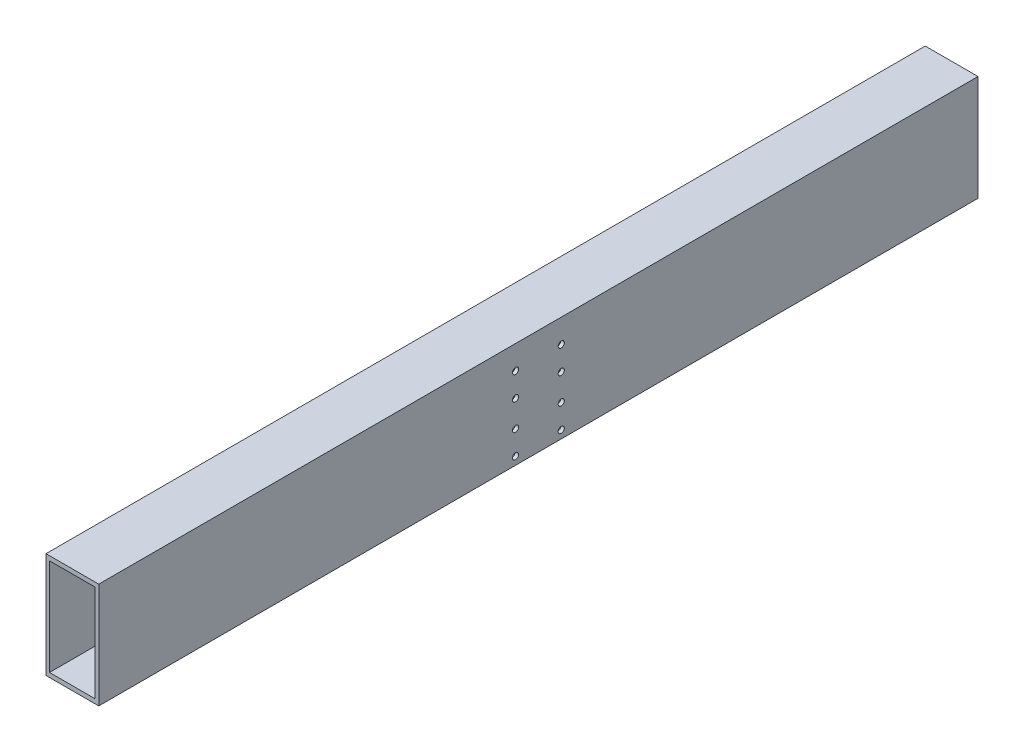
ISO-10303-21;
HEADER;
FILE_DESCRIPTION(('STEP AP214'),'2;1');
FILE_NAME('part.step','',(''),(''),'','','');
FILE_SCHEMA(('AUTOMOTIVE_DESIGN { 1 0 10303 214 1 1 1 1 }'));
ENDSEC;
DATA;
#1=APPLICATION_CONTEXT('core data for automotive mechanical design processes');
#2=APPLICATION_PROTOCOL_DEFINITION('international standard','automotive_design',2000,#1);
#3=PRODUCT_CONTEXT('',#1,'mechanical');
#4=PRODUCT('Part','Part','',(#3));
#5=PRODUCT_RELATED_PRODUCT_CATEGORY('part','',(#4));
#6=PRODUCT_DEFINITION_FORMATION('','',#4);
#7=PRODUCT_DEFINITION_CONTEXT('part definition',#1,'design');
#8=PRODUCT_DEFINITION('design','',#6,#7);
#9=PRODUCT_DEFINITION_SHAPE('','',#8);
#10=(LENGTH_UNIT() NAMED_UNIT(*) SI_UNIT(.MILLI.,.METRE.));
#11=(NAMED_UNIT(*) PLANE_ANGLE_UNIT() SI_UNIT($,.RADIAN.));
#12=(NAMED_UNIT(*) SI_UNIT($,.STERADIAN.) SOLID_ANGLE_UNIT());
#13=UNCERTAINTY_MEASURE_WITH_UNIT(LENGTH_MEASURE(1.E-05),#10,'distance_accuracy_value','');
#14=(GEOMETRIC_REPRESENTATION_CONTEXT(3) GLOBAL_UNCERTAINTY_ASSIGNED_CONTEXT((#13)) GLOBAL_UNIT_ASSIGNED_CONTEXT((#10,
#11,#12)) REPRESENTATION_CONTEXT('',''));
#15=CARTESIAN_POINT('',(0.,0.,0.));
#16=DIRECTION('',(0.,0.,1.));
#17=DIRECTION('',(1.,0.,0.));
#18=AXIS2_PLACEMENT_3D('',#15,#16,#17);
#19=CARTESIAN_POINT('',(-30.,60.,500.));
#20=DIRECTION('',(1.,0.,0.));
#21=DIRECTION('',(0.,0.,-1.));
#22=AXIS2_PLACEMENT_3D('',#19,#20,#21);
#23=PLANE('',#22);
#24=CARTESIAN_POINT('',(-30.,33.,26.));
#25=DIRECTION('',(1.,0.,0.));
#26=DIRECTION('',(0.,0.,-1.));
#27=AXIS2_PLACEMENT_3D('',#24,#25,#26);
#28=CIRCLE('',#27,3.49999999999999);
#29=CARTESIAN_POINT('',(-30.,33.,22.5));
#30=VERTEX_POINT('',#29);
#31=EDGE_CURVE('E538',#30,#30,#28,.T.);
#32=ORIENTED_EDGE('',*,*,#31,.T.);
#33=EDGE_LOOP('',(#32));
#34=FACE_BOUND('',#33,.T.);
#35=CARTESIAN_POINT('',(-30.,6.00000000000001,26.));
#36=DIRECTION('',(1.,0.,0.));
#37=DIRECTION('',(0.,0.,-1.));
#38=AXIS2_PLACEMENT_3D('',#35,#36,#37);
#39=CIRCLE('',#38,3.49999999999999);
#40=CARTESIAN_POINT('',(-30.,6.00000000000001,22.5));
#41=VERTEX_POINT('',#40);
#42=EDGE_CURVE('E552',#41,#41,#39,.T.);
#43=ORIENTED_EDGE('',*,*,#42,.T.);
#44=EDGE_LOOP('',(#43));
#45=FACE_BOUND('',#44,.T.);
#46=CARTESIAN_POINT('',(-30.,-24.,26.));
#47=DIRECTION('',(1.,0.,0.));
#48=DIRECTION('',(0.,0.,-1.));
#49=AXIS2_PLACEMENT_3D('',#46,#47,#48);
#50=CIRCLE('',#49,3.49999999999999);
#51=CARTESIAN_POINT('',(-30.,-24.,22.5));
#52=VERTEX_POINT('',#51);
#53=EDGE_CURVE('E147',#52,#52,#50,.T.);
#54=ORIENTED_EDGE('',*,*,#53,.T.);
#55=EDGE_LOOP('',(#54));
#56=FACE_BOUND('',#55,.T.);
#57=CARTESIAN_POINT('',(-30.,-51.,26.));
#58=DIRECTION('',(1.,0.,0.));
#59=DIRECTION('',(0.,0.,-1.));
#60=AXIS2_PLACEMENT_3D('',#57,#58,#59);
#61=CIRCLE('',#60,3.49999999999999);
#62=CARTESIAN_POINT('',(-30.,-51.,22.5));
#63=VERTEX_POINT('',#62);
#64=EDGE_CURVE('E143',#63,#63,#61,.T.);
#65=ORIENTED_EDGE('',*,*,#64,.T.);
#66=EDGE_LOOP('',(#65));
#67=FACE_BOUND('',#66,.T.);
#68=CARTESIAN_POINT('',(-30.,33.,-26.));
#69=DIRECTION('',(1.,0.,0.));
#70=DIRECTION('',(0.,0.,-1.));
#71=AXIS2_PLACEMENT_3D('',#68,#69,#70);
#72=CIRCLE('',#71,3.49999999999999);
#73=CARTESIAN_POINT('',(-30.,33.,-29.5));
#74=VERTEX_POINT('',#73);
#75=EDGE_CURVE('E139',#74,#74,#72,.T.);
#76=ORIENTED_EDGE('',*,*,#75,.T.);
#77=EDGE_LOOP('',(#76));
#78=FACE_BOUND('',#77,.T.);
#79=CARTESIAN_POINT('',(-30.,6.00000000000001,-26.));
#80=DIRECTION('',(1.,0.,0.));
#81=DIRECTION('',(0.,0.,-1.));
#82=AXIS2_PLACEMENT_3D('',#79,#80,#81);
#83=CIRCLE('',#82,3.49999999999999);
#84=CARTESIAN_POINT('',(-30.,6.00000000000001,-29.5));
#85=VERTEX_POINT('',#84);
#86=EDGE_CURVE('E134',#85,#85,#83,.T.);
#87=ORIENTED_EDGE('',*,*,#86,.T.);
#88=EDGE_LOOP('',(#87));
#89=FACE_BOUND('',#88,.T.);
#90=CARTESIAN_POINT('',(-30.,-24.,-26.));
#91=DIRECTION('',(1.,0.,0.));
#92=DIRECTION('',(0.,0.,-1.));
#93=AXIS2_PLACEMENT_3D('',#90,#91,#92);
#94=CIRCLE('',#93,3.49999999999999);
#95=CARTESIAN_POINT('',(-30.,-24.,-29.5));
#96=VERTEX_POINT('',#95);
#97=EDGE_CURVE('E129',#96,#96,#94,.T.);
#98=ORIENTED_EDGE('',*,*,#97,.T.);
#99=EDGE_LOOP('',(#98));
#100=FACE_BOUND('',#99,.T.);
#101=CARTESIAN_POINT('',(-30.,-51.,-26.));
#102=DIRECTION('',(1.,0.,0.));
#103=DIRECTION('',(0.,0.,-1.));
#104=AXIS2_PLACEMENT_3D('',#101,#102,#103);
#105=CIRCLE('',#104,3.49999999999999);
#106=CARTESIAN_POINT('',(-30.,-51.,-29.5));
#107=VERTEX_POINT('',#106);
#108=EDGE_CURVE('E124',#107,#107,#105,.T.);
#109=ORIENTED_EDGE('',*,*,#108,.T.);
#110=EDGE_LOOP('',(#109));
#111=FACE_BOUND('',#110,.T.);
#112=DIRECTION('',(0.,0.,-1.));
#113=VECTOR('',#112,1.);
#114=CARTESIAN_POINT('',(-30.,-60.,500.));
#115=LINE('',#114,#113);
#116=CARTESIAN_POINT('',(-30.,-60.,500.));
#117=VERTEX_POINT('',#116);
#118=CARTESIAN_POINT('',(-30.,-60.,-500.));
#119=VERTEX_POINT('',#118);
#120=EDGE_CURVE('E98',#117,#119,#115,.T.);
#121=ORIENTED_EDGE('',*,*,#120,.F.);
#122=DIRECTION('',(0.,-1.,0.));
#123=VECTOR('',#122,1.);
#124=CARTESIAN_POINT('',(-30.,60.,500.));
#125=LINE('',#124,#123);
#126=CARTESIAN_POINT('',(-30.,60.,500.));
#127=VERTEX_POINT('',#126);
#128=EDGE_CURVE('E86',#127,#117,#125,.T.);
#129=ORIENTED_EDGE('',*,*,#128,.F.);
#130=DIRECTION('',(0.,0.,-1.));
#131=VECTOR('',#130,1.);
#132=CARTESIAN_POINT('',(-30.,60.,500.));
#133=LINE('',#132,#131);
#134=CARTESIAN_POINT('',(-30.,60.,-500.));
#135=VERTEX_POINT('',#134);
#136=EDGE_CURVE('E103',#127,#135,#133,.T.);
#137=ORIENTED_EDGE('',*,*,#136,.T.);
#138=DIRECTION('',(0.,-1.,0.));
#139=VECTOR('',#138,1.);
#140=CARTESIAN_POINT('',(-30.,60.,-500.));
#141=LINE('',#140,#139);
#142=EDGE_CURVE('E99',#135,#119,#141,.T.);
#143=ORIENTED_EDGE('',*,*,#142,.T.);
#144=EDGE_LOOP('',(#121,#129,#137,#143));
#145=FACE_BOUND('',#144,.T.);
#146=ADVANCED_FACE('F34',(#34,#45,#56,#67,#78,#89,#100,#111,#145),#23,.F.);
#147=CARTESIAN_POINT('',(-30.,-60.,500.));
#148=DIRECTION('',(0.,1.,0.));
#149=DIRECTION('',(-1.,0.,0.));
#150=AXIS2_PLACEMENT_3D('',#147,#148,#149);
#151=PLANE('',#150);
#152=DIRECTION('',(0.,0.,-1.));
#153=VECTOR('',#152,1.);
#154=CARTESIAN_POINT('',(30.,-60.,500.));
#155=LINE('',#154,#153);
#156=CARTESIAN_POINT('',(30.,-60.,500.));
#157=VERTEX_POINT('',#156);
#158=CARTESIAN_POINT('',(30.,-60.,-500.));
#159=VERTEX_POINT('',#158);
#160=EDGE_CURVE('E102',#157,#159,#155,.T.);
#161=ORIENTED_EDGE('',*,*,#160,.F.);
#162=DIRECTION('',(1.,0.,0.));
#163=VECTOR('',#162,1.);
#164=CARTESIAN_POINT('',(-30.,-60.,500.));
#165=LINE('',#164,#163);
#166=EDGE_CURVE('E83',#117,#157,#165,.T.);
#167=ORIENTED_EDGE('',*,*,#166,.F.);
#168=ORIENTED_EDGE('',*,*,#120,.T.);
#169=DIRECTION('',(1.,0.,0.));
#170=VECTOR('',#169,1.);
#171=CARTESIAN_POINT('',(-30.,-60.,-500.));
#172=LINE('',#171,#170);
#173=EDGE_CURVE('E227',#119,#159,#172,.T.);
#174=ORIENTED_EDGE('',*,*,#173,.T.);
#175=EDGE_LOOP('',(#161,#167,#168,#174));
#176=FACE_BOUND('',#175,.T.);
#177=ADVANCED_FACE('F105',(#176),#151,.F.);
#178=CARTESIAN_POINT('',(30.,60.,500.));
#179=DIRECTION('',(-1.,0.,0.));
#180=DIRECTION('',(0.,-1.,0.));
#181=AXIS2_PLACEMENT_3D('',#178,#179,#180);
#182=PLANE('',#181);
#183=CARTESIAN_POINT('',(30.,33.,26.));
#184=DIRECTION('',(1.,0.,0.));
#185=DIRECTION('',(0.,0.,-1.));
#186=AXIS2_PLACEMENT_3D('',#183,#184,#185);
#187=CIRCLE('',#186,3.49999999999999);
#188=CARTESIAN_POINT('',(30.,33.,22.5));
#189=VERTEX_POINT('',#188);
#190=EDGE_CURVE('E546',#189,#189,#187,.T.);
#191=ORIENTED_EDGE('',*,*,#190,.F.);
#192=EDGE_LOOP('',(#191));
#193=FACE_BOUND('',#192,.T.);
#194=CARTESIAN_POINT('',(30.,6.00000000000001,26.));
#195=DIRECTION('',(1.,0.,0.));
#196=DIRECTION('',(0.,0.,-1.));
#197=AXIS2_PLACEMENT_3D('',#194,#195,#196);
#198=CIRCLE('',#197,3.49999999999999);
#199=CARTESIAN_POINT('',(30.,6.00000000000001,22.5));
#200=VERTEX_POINT('',#199);
#201=EDGE_CURVE('E544',#200,#200,#198,.T.);
#202=ORIENTED_EDGE('',*,*,#201,.F.);
#203=EDGE_LOOP('',(#202));
#204=FACE_BOUND('',#203,.T.);
#205=CARTESIAN_POINT('',(30.,-24.,26.));
#206=DIRECTION('',(1.,0.,0.));
#207=DIRECTION('',(0.,0.,-1.));
#208=AXIS2_PLACEMENT_3D('',#205,#206,#207);
#209=CIRCLE('',#208,3.49999999999999);
#210=CARTESIAN_POINT('',(30.,-24.,22.5));
#211=VERTEX_POINT('',#210);
#212=EDGE_CURVE('E154',#211,#211,#209,.T.);
#213=ORIENTED_EDGE('',*,*,#212,.F.);
#214=EDGE_LOOP('',(#213));
#215=FACE_BOUND('',#214,.T.);
#216=CARTESIAN_POINT('',(30.,-51.,26.));
#217=DIRECTION('',(1.,0.,0.));
#218=DIRECTION('',(0.,0.,-1.));
#219=AXIS2_PLACEMENT_3D('',#216,#217,#218);
#220=CIRCLE('',#219,3.49999999999999);
#221=CARTESIAN_POINT('',(30.,-51.,22.5));
#222=VERTEX_POINT('',#221);
#223=EDGE_CURVE('E151',#222,#222,#220,.T.);
#224=ORIENTED_EDGE('',*,*,#223,.F.);
#225=EDGE_LOOP('',(#224));
#226=FACE_BOUND('',#225,.T.);
#227=CARTESIAN_POINT('',(30.,33.,-26.));
#228=DIRECTION('',(1.,0.,0.));
#229=DIRECTION('',(0.,0.,-1.));
#230=AXIS2_PLACEMENT_3D('',#227,#228,#229);
#231=CIRCLE('',#230,3.49999999999999);
#232=CARTESIAN_POINT('',(30.,33.,-29.5));
#233=VERTEX_POINT('',#232);
#234=EDGE_CURVE('E169',#233,#233,#231,.T.);
#235=ORIENTED_EDGE('',*,*,#234,.F.);
#236=EDGE_LOOP('',(#235));
#237=FACE_BOUND('',#236,.T.);
#238=CARTESIAN_POINT('',(30.,6.00000000000001,-26.));
#239=DIRECTION('',(1.,0.,0.));
#240=DIRECTION('',(0.,0.,-1.));
#241=AXIS2_PLACEMENT_3D('',#238,#239,#240);
#242=CIRCLE('',#241,3.49999999999999);
#243=CARTESIAN_POINT('',(30.,6.00000000000001,-29.5));
#244=VERTEX_POINT('',#243);
#245=EDGE_CURVE('E176',#244,#244,#242,.T.);
#246=ORIENTED_EDGE('',*,*,#245,.F.);
#247=EDGE_LOOP('',(#246));
#248=FACE_BOUND('',#247,.T.);
#249=CARTESIAN_POINT('',(30.,-24.,-26.));
#250=DIRECTION('',(1.,0.,0.));
#251=DIRECTION('',(0.,0.,-1.));
#252=AXIS2_PLACEMENT_3D('',#249,#250,#251);
#253=CIRCLE('',#252,3.49999999999999);
#254=CARTESIAN_POINT('',(30.,-24.,-29.5));
#255=VERTEX_POINT('',#254);
#256=EDGE_CURVE('E183',#255,#255,#253,.T.);
#257=ORIENTED_EDGE('',*,*,#256,.F.);
#258=EDGE_LOOP('',(#257));
#259=FACE_BOUND('',#258,.T.);
#260=CARTESIAN_POINT('',(30.,-51.,-26.));
#261=DIRECTION('',(1.,0.,0.));
#262=DIRECTION('',(0.,0.,-1.));
#263=AXIS2_PLACEMENT_3D('',#260,#261,#262);
#264=CIRCLE('',#263,3.49999999999999);
#265=CARTESIAN_POINT('',(30.,-51.,-29.5));
#266=VERTEX_POINT('',#265);
#267=EDGE_CURVE('E190',#266,#266,#264,.T.);
#268=ORIENTED_EDGE('',*,*,#267,.F.);
#269=EDGE_LOOP('',(#268));
#270=FACE_BOUND('',#269,.T.);
#271=DIRECTION('',(0.,0.,-1.));
#272=VECTOR('',#271,1.);
#273=CARTESIAN_POINT('',(30.,60.,500.));
#274=LINE('',#273,#272);
#275=CARTESIAN_POINT('',(30.,60.,500.));
#276=VERTEX_POINT('',#275);
#277=CARTESIAN_POINT('',(30.,60.,-500.));
#278=VERTEX_POINT('',#277);
#279=EDGE_CURVE('E94',#276,#278,#274,.T.);
#280=ORIENTED_EDGE('',*,*,#279,.F.);
#281=DIRECTION('',(0.,1.,0.));
#282=VECTOR('',#281,1.);
#283=CARTESIAN_POINT('',(30.,60.,500.));
#284=LINE('',#283,#282);
#285=EDGE_CURVE('E108',#157,#276,#284,.T.);
#286=ORIENTED_EDGE('',*,*,#285,.F.);
#287=ORIENTED_EDGE('',*,*,#160,.T.);
#288=DIRECTION('',(0.,1.,0.));
#289=VECTOR('',#288,1.);
#290=CARTESIAN_POINT('',(30.,60.,-500.));
#291=LINE('',#290,#289);
#292=EDGE_CURVE('E112',#159,#278,#291,.T.);
#293=ORIENTED_EDGE('',*,*,#292,.T.);
#294=EDGE_LOOP('',(#280,#286,#287,#293));
#295=FACE_BOUND('',#294,.T.);
#296=ADVANCED_FACE('F234',(#193,#204,#215,#226,#237,#248,#259,#270,#295),#182,.F.);
#297=CARTESIAN_POINT('',(-30.,60.,500.));
#298=DIRECTION('',(0.,-1.,0.));
#299=DIRECTION('',(1.,0.,0.));
#300=AXIS2_PLACEMENT_3D('',#297,#298,#299);
#301=PLANE('',#300);
#302=DIRECTION('',(-1.,0.,0.));
#303=VECTOR('',#302,1.);
#304=CARTESIAN_POINT('',(-30.,60.,-500.));
#305=LINE('',#304,#303);
#306=EDGE_CURVE('E201',#278,#135,#305,.T.);
#307=ORIENTED_EDGE('',*,*,#306,.T.);
#308=ORIENTED_EDGE('',*,*,#136,.F.);
#309=DIRECTION('',(-1.,0.,0.));
#310=VECTOR('',#309,1.);
#311=CARTESIAN_POINT('',(-30.,60.,500.));
#312=LINE('',#311,#310);
#313=EDGE_CURVE('E90',#276,#127,#312,.T.);
#314=ORIENTED_EDGE('',*,*,#313,.F.);
#315=ORIENTED_EDGE('',*,*,#279,.T.);
#316=EDGE_LOOP('',(#307,#308,#314,#315));
#317=FACE_BOUND('',#316,.T.);
#318=ADVANCED_FACE('F36',(#317),#301,.F.);
#319=CARTESIAN_POINT('',(0.,0.,500.));
#320=DIRECTION('',(0.,0.,1.));
#321=DIRECTION('',(1.,0.,0.));
#322=AXIS2_PLACEMENT_3D('',#319,#320,#321);
#323=PLANE('',#322);
#324=DIRECTION('',(0.,-1.,0.));
#325=VECTOR('',#324,1.);
#326=CARTESIAN_POINT('',(-26.,55.,500.));
#327=LINE('',#326,#325);
#328=CARTESIAN_POINT('',(-26.,-55.,500.));
#329=VERTEX_POINT('',#328);
#330=CARTESIAN_POINT('',(-26.,55.,500.));
#331=VERTEX_POINT('',#330);
#332=EDGE_CURVE('E214',#329,#331,#327,.F.);
#333=ORIENTED_EDGE('',*,*,#332,.T.);
#334=DIRECTION('',(-1.,0.,0.));
#335=VECTOR('',#334,1.);
#336=CARTESIAN_POINT('',(-26.,55.,500.));
#337=LINE('',#336,#335);
#338=CARTESIAN_POINT('',(26.,55.,500.));
#339=VERTEX_POINT('',#338);
#340=EDGE_CURVE('E197',#331,#339,#337,.F.);
#341=ORIENTED_EDGE('',*,*,#340,.T.);
#342=DIRECTION('',(0.,1.,0.));
#343=VECTOR('',#342,1.);
#344=CARTESIAN_POINT('',(26.,55.,500.));
#345=LINE('',#344,#343);
#346=CARTESIAN_POINT('',(26.,-55.,500.));
#347=VERTEX_POINT('',#346);
#348=EDGE_CURVE('E200',#339,#347,#345,.F.);
#349=ORIENTED_EDGE('',*,*,#348,.T.);
#350=DIRECTION('',(1.,0.,0.));
#351=VECTOR('',#350,1.);
#352=CARTESIAN_POINT('',(-26.,-55.,500.));
#353=LINE('',#352,#351);
#354=EDGE_CURVE('E217',#347,#329,#353,.F.);
#355=ORIENTED_EDGE('',*,*,#354,.T.);
#356=EDGE_LOOP('',(#333,#341,#349,#355));
#357=FACE_BOUND('',#356,.T.);
#358=ORIENTED_EDGE('',*,*,#128,.T.);
#359=ORIENTED_EDGE('',*,*,#166,.T.);
#360=ORIENTED_EDGE('',*,*,#285,.T.);
#361=ORIENTED_EDGE('',*,*,#313,.T.);
#362=EDGE_LOOP('',(#358,#359,#360,#361));
#363=FACE_BOUND('',#362,.T.);
#364=ADVANCED_FACE('F88',(#357,#363),#323,.T.);
#365=CARTESIAN_POINT('',(0.,0.,-500.));
#366=DIRECTION('',(0.,0.,1.));
#367=DIRECTION('',(1.,0.,0.));
#368=AXIS2_PLACEMENT_3D('',#365,#366,#367);
#369=PLANE('',#368);
#370=DIRECTION('',(0.,-1.,0.));
#371=VECTOR('',#370,1.);
#372=CARTESIAN_POINT('',(-26.,55.,-500.));
#373=LINE('',#372,#371);
#374=CARTESIAN_POINT('',(-26.,-55.,-500.));
#375=VERTEX_POINT('',#374);
#376=CARTESIAN_POINT('',(-26.,55.,-500.));
#377=VERTEX_POINT('',#376);
#378=EDGE_CURVE('E11',#375,#377,#373,.F.);
#379=ORIENTED_EDGE('',*,*,#378,.F.);
#380=DIRECTION('',(1.,0.,0.));
#381=VECTOR('',#380,1.);
#382=CARTESIAN_POINT('',(-26.,-55.,-500.));
#383=LINE('',#382,#381);
#384=CARTESIAN_POINT('',(26.,-55.,-500.));
#385=VERTEX_POINT('',#384);
#386=EDGE_CURVE('E44',#385,#375,#383,.F.);
#387=ORIENTED_EDGE('',*,*,#386,.F.);
#388=DIRECTION('',(0.,1.,0.));
#389=VECTOR('',#388,1.);
#390=CARTESIAN_POINT('',(26.,55.,-500.));
#391=LINE('',#390,#389);
#392=CARTESIAN_POINT('',(26.,55.,-500.));
#393=VERTEX_POINT('',#392);
#394=EDGE_CURVE('E205',#393,#385,#391,.F.);
#395=ORIENTED_EDGE('',*,*,#394,.F.);
#396=DIRECTION('',(-1.,0.,0.));
#397=VECTOR('',#396,1.);
#398=CARTESIAN_POINT('',(-26.,55.,-500.));
#399=LINE('',#398,#397);
#400=EDGE_CURVE('E202',#377,#393,#399,.F.);
#401=ORIENTED_EDGE('',*,*,#400,.F.);
#402=EDGE_LOOP('',(#379,#387,#395,#401));
#403=FACE_BOUND('',#402,.T.);
#404=ORIENTED_EDGE('',*,*,#142,.F.);
#405=ORIENTED_EDGE('',*,*,#306,.F.);
#406=ORIENTED_EDGE('',*,*,#292,.F.);
#407=ORIENTED_EDGE('',*,*,#173,.F.);
#408=EDGE_LOOP('',(#404,#405,#406,#407));
#409=FACE_BOUND('',#408,.T.);
#410=ADVANCED_FACE('F236',(#403,#409),#369,.F.);
#411=CARTESIAN_POINT('',(-26.,55.,500.));
#412=DIRECTION('',(0.,1.,0.));
#413=DIRECTION('',(-1.,0.,0.));
#414=AXIS2_PLACEMENT_3D('',#411,#412,#413);
#415=PLANE('',#414);
#416=DIRECTION('',(0.,0.,-1.));
#417=VECTOR('',#416,1.);
#418=CARTESIAN_POINT('',(26.,55.,500.));
#419=LINE('',#418,#417);
#420=EDGE_CURVE('E207',#339,#393,#419,.T.);
#421=ORIENTED_EDGE('',*,*,#420,.F.);
#422=ORIENTED_EDGE('',*,*,#340,.F.);
#423=DIRECTION('',(0.,0.,-1.));
#424=VECTOR('',#423,1.);
#425=CARTESIAN_POINT('',(-26.,55.,500.));
#426=LINE('',#425,#424);
#427=EDGE_CURVE('E211',#331,#377,#426,.T.);
#428=ORIENTED_EDGE('',*,*,#427,.T.);
#429=ORIENTED_EDGE('',*,*,#400,.T.);
#430=EDGE_LOOP('',(#421,#422,#428,#429));
#431=FACE_BOUND('',#430,.T.);
#432=ADVANCED_FACE('F265',(#431),#415,.F.);
#433=CARTESIAN_POINT('',(26.,55.,500.));
#434=DIRECTION('',(1.,0.,0.));
#435=DIRECTION('',(0.,0.,-1.));
#436=AXIS2_PLACEMENT_3D('',#433,#434,#435);
#437=PLANE('',#436);
#438=CARTESIAN_POINT('',(26.,33.,26.));
#439=DIRECTION('',(1.,0.,0.));
#440=DIRECTION('',(0.,0.,-1.));
#441=AXIS2_PLACEMENT_3D('',#438,#439,#440);
#442=CIRCLE('',#441,3.49999999999999);
#443=CARTESIAN_POINT('',(26.,33.,22.5));
#444=VERTEX_POINT('',#443);
#445=EDGE_CURVE('E541',#444,#444,#442,.T.);
#446=ORIENTED_EDGE('',*,*,#445,.T.);
#447=EDGE_LOOP('',(#446));
#448=FACE_BOUND('',#447,.T.);
#449=CARTESIAN_POINT('',(26.,6.00000000000001,26.));
#450=DIRECTION('',(1.,0.,0.));
#451=DIRECTION('',(0.,0.,-1.));
#452=AXIS2_PLACEMENT_3D('',#449,#450,#451);
#453=CIRCLE('',#452,3.49999999999999);
#454=CARTESIAN_POINT('',(26.,6.00000000000001,22.5));
#455=VERTEX_POINT('',#454);
#456=EDGE_CURVE('E159',#455,#455,#453,.T.);
#457=ORIENTED_EDGE('',*,*,#456,.T.);
#458=EDGE_LOOP('',(#457));
#459=FACE_BOUND('',#458,.T.);
#460=CARTESIAN_POINT('',(26.,-24.,26.));
#461=DIRECTION('',(1.,0.,0.));
#462=DIRECTION('',(0.,0.,-1.));
#463=AXIS2_PLACEMENT_3D('',#460,#461,#462);
#464=CIRCLE('',#463,3.49999999999999);
#465=CARTESIAN_POINT('',(26.,-24.,22.5));
#466=VERTEX_POINT('',#465);
#467=EDGE_CURVE('E146',#466,#466,#464,.T.);
#468=ORIENTED_EDGE('',*,*,#467,.T.);
#469=EDGE_LOOP('',(#468));
#470=FACE_BOUND('',#469,.T.);
#471=CARTESIAN_POINT('',(26.,-51.,26.));
#472=DIRECTION('',(1.,0.,0.));
#473=DIRECTION('',(0.,0.,-1.));
#474=AXIS2_PLACEMENT_3D('',#471,#472,#473);
#475=CIRCLE('',#474,3.49999999999999);
#476=CARTESIAN_POINT('',(26.,-51.,22.5));
#477=VERTEX_POINT('',#476);
#478=EDGE_CURVE('E142',#477,#477,#475,.T.);
#479=ORIENTED_EDGE('',*,*,#478,.T.);
#480=EDGE_LOOP('',(#479));
#481=FACE_BOUND('',#480,.T.);
#482=CARTESIAN_POINT('',(26.,33.,-26.));
#483=DIRECTION('',(1.,0.,0.));
#484=DIRECTION('',(0.,0.,-1.));
#485=AXIS2_PLACEMENT_3D('',#482,#483,#484);
#486=CIRCLE('',#485,3.49999999999999);
#487=CARTESIAN_POINT('',(26.,33.,-29.5));
#488=VERTEX_POINT('',#487);
#489=EDGE_CURVE('E138',#488,#488,#486,.T.);
#490=ORIENTED_EDGE('',*,*,#489,.T.);
#491=EDGE_LOOP('',(#490));
#492=FACE_BOUND('',#491,.T.);
#493=CARTESIAN_POINT('',(26.,6.00000000000001,-26.));
#494=DIRECTION('',(1.,0.,0.));
#495=DIRECTION('',(0.,0.,-1.));
#496=AXIS2_PLACEMENT_3D('',#493,#494,#495);
#497=CIRCLE('',#496,3.49999999999999);
#498=CARTESIAN_POINT('',(26.,6.00000000000001,-29.5));
#499=VERTEX_POINT('',#498);
#500=EDGE_CURVE('E133',#499,#499,#497,.T.);
#501=ORIENTED_EDGE('',*,*,#500,.T.);
#502=EDGE_LOOP('',(#501));
#503=FACE_BOUND('',#502,.T.);
#504=CARTESIAN_POINT('',(26.,-24.,-26.));
#505=DIRECTION('',(1.,0.,0.));
#506=DIRECTION('',(0.,0.,-1.));
#507=AXIS2_PLACEMENT_3D('',#504,#505,#506);
#508=CIRCLE('',#507,3.49999999999999);
#509=CARTESIAN_POINT('',(26.,-24.,-29.5));
#510=VERTEX_POINT('',#509);
#511=EDGE_CURVE('E125',#510,#510,#508,.T.);
#512=ORIENTED_EDGE('',*,*,#511,.T.);
#513=EDGE_LOOP('',(#512));
#514=FACE_BOUND('',#513,.T.);
#515=CARTESIAN_POINT('',(26.,-51.,-26.));
#516=DIRECTION('',(1.,0.,0.));
#517=DIRECTION('',(0.,0.,-1.));
#518=AXIS2_PLACEMENT_3D('',#515,#516,#517);
#519=CIRCLE('',#518,3.49999999999999);
#520=CARTESIAN_POINT('',(26.,-51.,-29.5));
#521=VERTEX_POINT('',#520);
#522=EDGE_CURVE('E117',#521,#521,#519,.T.);
#523=ORIENTED_EDGE('',*,*,#522,.T.);
#524=EDGE_LOOP('',(#523));
#525=FACE_BOUND('',#524,.T.);
#526=DIRECTION('',(0.,0.,-1.));
#527=VECTOR('',#526,1.);
#528=CARTESIAN_POINT('',(26.,-55.,500.));
#529=LINE('',#528,#527);
#530=EDGE_CURVE('E210',#347,#385,#529,.T.);
#531=ORIENTED_EDGE('',*,*,#530,.F.);
#532=ORIENTED_EDGE('',*,*,#348,.F.);
#533=ORIENTED_EDGE('',*,*,#420,.T.);
#534=ORIENTED_EDGE('',*,*,#394,.T.);
#535=EDGE_LOOP('',(#531,#532,#533,#534));
#536=FACE_BOUND('',#535,.T.);
#537=ADVANCED_FACE('F258',(#448,#459,#470,#481,#492,#503,#514,#525,#536),#437,.F.);
#538=CARTESIAN_POINT('',(-26.,-55.,500.));
#539=DIRECTION('',(0.,-1.,0.));
#540=DIRECTION('',(1.,0.,0.));
#541=AXIS2_PLACEMENT_3D('',#538,#539,#540);
#542=PLANE('',#541);
#543=DIRECTION('',(0.,0.,-1.));
#544=VECTOR('',#543,1.);
#545=CARTESIAN_POINT('',(-26.,-55.,500.));
#546=LINE('',#545,#544);
#547=EDGE_CURVE('E206',#329,#375,#546,.T.);
#548=ORIENTED_EDGE('',*,*,#547,.F.);
#549=ORIENTED_EDGE('',*,*,#354,.F.);
#550=ORIENTED_EDGE('',*,*,#530,.T.);
#551=ORIENTED_EDGE('',*,*,#386,.T.);
#552=EDGE_LOOP('',(#548,#549,#550,#551));
#553=FACE_BOUND('',#552,.T.);
#554=ADVANCED_FACE('F248',(#553),#542,.F.);
#555=CARTESIAN_POINT('',(-26.,55.,500.));
#556=DIRECTION('',(-1.,0.,0.));
#557=DIRECTION('',(0.,0.,1.));
#558=AXIS2_PLACEMENT_3D('',#555,#556,#557);
#559=PLANE('',#558);
#560=CARTESIAN_POINT('',(-26.,33.,26.));
#561=DIRECTION('',(-1.,0.,0.));
#562=DIRECTION('',(0.,0.,1.));
#563=AXIS2_PLACEMENT_3D('',#560,#561,#562);
#564=CIRCLE('',#563,3.49999999999999);
#565=CARTESIAN_POINT('',(-26.,33.,29.5));
#566=VERTEX_POINT('',#565);
#567=EDGE_CURVE('E540',#566,#566,#564,.T.);
#568=ORIENTED_EDGE('',*,*,#567,.T.);
#569=EDGE_LOOP('',(#568));
#570=FACE_BOUND('',#569,.T.);
#571=CARTESIAN_POINT('',(-26.,6.00000000000001,26.));
#572=DIRECTION('',(-1.,0.,0.));
#573=DIRECTION('',(0.,0.,1.));
#574=AXIS2_PLACEMENT_3D('',#571,#572,#573);
#575=CIRCLE('',#574,3.49999999999999);
#576=CARTESIAN_POINT('',(-26.,6.00000000000001,29.5));
#577=VERTEX_POINT('',#576);
#578=EDGE_CURVE('E38',#577,#577,#575,.T.);
#579=ORIENTED_EDGE('',*,*,#578,.T.);
#580=EDGE_LOOP('',(#579));
#581=FACE_BOUND('',#580,.T.);
#582=CARTESIAN_POINT('',(-26.,-24.,26.));
#583=DIRECTION('',(-1.,0.,0.));
#584=DIRECTION('',(0.,0.,1.));
#585=AXIS2_PLACEMENT_3D('',#582,#583,#584);
#586=CIRCLE('',#585,3.49999999999999);
#587=CARTESIAN_POINT('',(-26.,-24.,29.5));
#588=VERTEX_POINT('',#587);
#589=EDGE_CURVE('E144',#588,#588,#586,.T.);
#590=ORIENTED_EDGE('',*,*,#589,.T.);
#591=EDGE_LOOP('',(#590));
#592=FACE_BOUND('',#591,.T.);
#593=CARTESIAN_POINT('',(-26.,-51.,26.));
#594=DIRECTION('',(-1.,0.,0.));
#595=DIRECTION('',(0.,0.,1.));
#596=AXIS2_PLACEMENT_3D('',#593,#594,#595);
#597=CIRCLE('',#596,3.49999999999999);
#598=CARTESIAN_POINT('',(-26.,-51.,29.5));
#599=VERTEX_POINT('',#598);
#600=EDGE_CURVE('E140',#599,#599,#597,.T.);
#601=ORIENTED_EDGE('',*,*,#600,.T.);
#602=EDGE_LOOP('',(#601));
#603=FACE_BOUND('',#602,.T.);
#604=CARTESIAN_POINT('',(-26.,33.,-26.));
#605=DIRECTION('',(-1.,0.,0.));
#606=DIRECTION('',(0.,0.,1.));
#607=AXIS2_PLACEMENT_3D('',#604,#605,#606);
#608=CIRCLE('',#607,3.49999999999999);
#609=CARTESIAN_POINT('',(-26.,33.,-22.5));
#610=VERTEX_POINT('',#609);
#611=EDGE_CURVE('E135',#610,#610,#608,.T.);
#612=ORIENTED_EDGE('',*,*,#611,.T.);
#613=EDGE_LOOP('',(#612));
#614=FACE_BOUND('',#613,.T.);
#615=CARTESIAN_POINT('',(-26.,6.00000000000001,-26.));
#616=DIRECTION('',(-1.,0.,0.));
#617=DIRECTION('',(0.,0.,1.));
#618=AXIS2_PLACEMENT_3D('',#615,#616,#617);
#619=CIRCLE('',#618,3.49999999999999);
#620=CARTESIAN_POINT('',(-26.,6.00000000000001,-22.5));
#621=VERTEX_POINT('',#620);
#622=EDGE_CURVE('E130',#621,#621,#619,.T.);
#623=ORIENTED_EDGE('',*,*,#622,.T.);
#624=EDGE_LOOP('',(#623));
#625=FACE_BOUND('',#624,.T.);
#626=CARTESIAN_POINT('',(-26.,-24.,-26.));
#627=DIRECTION('',(-1.,0.,0.));
#628=DIRECTION('',(0.,0.,1.));
#629=AXIS2_PLACEMENT_3D('',#626,#627,#628);
#630=CIRCLE('',#629,3.49999999999999);
#631=CARTESIAN_POINT('',(-26.,-24.,-22.5));
#632=VERTEX_POINT('',#631);
#633=EDGE_CURVE('E128',#632,#632,#630,.T.);
#634=ORIENTED_EDGE('',*,*,#633,.T.);
#635=EDGE_LOOP('',(#634));
#636=FACE_BOUND('',#635,.T.);
#637=CARTESIAN_POINT('',(-26.,-51.,-26.));
#638=DIRECTION('',(-1.,0.,0.));
#639=DIRECTION('',(0.,0.,1.));
#640=AXIS2_PLACEMENT_3D('',#637,#638,#639);
#641=CIRCLE('',#640,3.49999999999999);
#642=CARTESIAN_POINT('',(-26.,-51.,-22.5));
#643=VERTEX_POINT('',#642);
#644=EDGE_CURVE('E121',#643,#643,#641,.T.);
#645=ORIENTED_EDGE('',*,*,#644,.T.);
#646=EDGE_LOOP('',(#645));
#647=FACE_BOUND('',#646,.T.);
#648=ORIENTED_EDGE('',*,*,#378,.T.);
#649=ORIENTED_EDGE('',*,*,#427,.F.);
#650=ORIENTED_EDGE('',*,*,#332,.F.);
#651=ORIENTED_EDGE('',*,*,#547,.T.);
#652=EDGE_LOOP('',(#648,#649,#650,#651));
#653=FACE_BOUND('',#652,.T.);
#654=ADVANCED_FACE('F245',(#570,#581,#592,#603,#614,#625,#636,#647,#653),#559,.F.);
#655=CARTESIAN_POINT('',(30.,-51.,-26.));
#656=DIRECTION('',(1.,0.,0.));
#657=DIRECTION('',(0.,0.,-1.));
#658=AXIS2_PLACEMENT_3D('',#655,#656,#657);
#659=CYLINDRICAL_SURFACE('',#658,3.49999999999999);
#660=ORIENTED_EDGE('',*,*,#108,.F.);
#661=EDGE_LOOP('',(#660));
#662=FACE_BOUND('',#661,.T.);
#663=ORIENTED_EDGE('',*,*,#644,.F.);
#664=EDGE_LOOP('',(#663));
#665=FACE_BOUND('',#664,.T.);
#666=ADVANCED_FACE('F247',(#662,#665),#659,.F.);
#667=ORIENTED_EDGE('',*,*,#267,.T.);
#668=EDGE_LOOP('',(#667));
#669=FACE_BOUND('',#668,.T.);
#670=ORIENTED_EDGE('',*,*,#522,.F.);
#671=EDGE_LOOP('',(#670));
#672=FACE_BOUND('',#671,.T.);
#673=ADVANCED_FACE('F255',(#669,#672),#659,.F.);
#674=CARTESIAN_POINT('',(30.,-24.,-26.));
#675=DIRECTION('',(1.,0.,0.));
#676=DIRECTION('',(0.,0.,-1.));
#677=AXIS2_PLACEMENT_3D('',#674,#675,#676);
#678=CYLINDRICAL_SURFACE('',#677,3.49999999999999);
#679=ORIENTED_EDGE('',*,*,#256,.T.);
#680=EDGE_LOOP('',(#679));
#681=FACE_BOUND('',#680,.T.);
#682=ORIENTED_EDGE('',*,*,#511,.F.);
#683=EDGE_LOOP('',(#682));
#684=FACE_BOUND('',#683,.T.);
#685=ADVANCED_FACE('F396',(#681,#684),#678,.F.);
#686=ORIENTED_EDGE('',*,*,#97,.F.);
#687=EDGE_LOOP('',(#686));
#688=FACE_BOUND('',#687,.T.);
#689=ORIENTED_EDGE('',*,*,#633,.F.);
#690=EDGE_LOOP('',(#689));
#691=FACE_BOUND('',#690,.T.);
#692=ADVANCED_FACE('F394',(#688,#691),#678,.F.);
#693=CARTESIAN_POINT('',(30.,6.00000000000001,-26.));
#694=DIRECTION('',(1.,0.,0.));
#695=DIRECTION('',(0.,0.,-1.));
#696=AXIS2_PLACEMENT_3D('',#693,#694,#695);
#697=CYLINDRICAL_SURFACE('',#696,3.49999999999999);
#698=ORIENTED_EDGE('',*,*,#86,.F.);
#699=EDGE_LOOP('',(#698));
#700=FACE_BOUND('',#699,.T.);
#701=ORIENTED_EDGE('',*,*,#622,.F.);
#702=EDGE_LOOP('',(#701));
#703=FACE_BOUND('',#702,.T.);
#704=ADVANCED_FACE('F392',(#700,#703),#697,.F.);
#705=ORIENTED_EDGE('',*,*,#245,.T.);
#706=EDGE_LOOP('',(#705));
#707=FACE_BOUND('',#706,.T.);
#708=ORIENTED_EDGE('',*,*,#500,.F.);
#709=EDGE_LOOP('',(#708));
#710=FACE_BOUND('',#709,.T.);
#711=ADVANCED_FACE('F389',(#707,#710),#697,.F.);
#712=CARTESIAN_POINT('',(30.,33.,-26.));
#713=DIRECTION('',(1.,0.,0.));
#714=DIRECTION('',(0.,0.,-1.));
#715=AXIS2_PLACEMENT_3D('',#712,#713,#714);
#716=CYLINDRICAL_SURFACE('',#715,3.49999999999999);
#717=ORIENTED_EDGE('',*,*,#75,.F.);
#718=EDGE_LOOP('',(#717));
#719=FACE_BOUND('',#718,.T.);
#720=ORIENTED_EDGE('',*,*,#611,.F.);
#721=EDGE_LOOP('',(#720));
#722=FACE_BOUND('',#721,.T.);
#723=ADVANCED_FACE('F387',(#719,#722),#716,.F.);
#724=ORIENTED_EDGE('',*,*,#234,.T.);
#725=EDGE_LOOP('',(#724));
#726=FACE_BOUND('',#725,.T.);
#727=ORIENTED_EDGE('',*,*,#489,.F.);
#728=EDGE_LOOP('',(#727));
#729=FACE_BOUND('',#728,.T.);
#730=ADVANCED_FACE('F311',(#726,#729),#716,.F.);
#731=CARTESIAN_POINT('',(30.,-51.,26.));
#732=DIRECTION('',(1.,0.,0.));
#733=DIRECTION('',(0.,0.,-1.));
#734=AXIS2_PLACEMENT_3D('',#731,#732,#733);
#735=CYLINDRICAL_SURFACE('',#734,3.49999999999999);
#736=ORIENTED_EDGE('',*,*,#64,.F.);
#737=EDGE_LOOP('',(#736));
#738=FACE_BOUND('',#737,.T.);
#739=ORIENTED_EDGE('',*,*,#600,.F.);
#740=EDGE_LOOP('',(#739));
#741=FACE_BOUND('',#740,.T.);
#742=ADVANCED_FACE('F305',(#738,#741),#735,.F.);
#743=ORIENTED_EDGE('',*,*,#223,.T.);
#744=EDGE_LOOP('',(#743));
#745=FACE_BOUND('',#744,.T.);
#746=ORIENTED_EDGE('',*,*,#478,.F.);
#747=EDGE_LOOP('',(#746));
#748=FACE_BOUND('',#747,.T.);
#749=ADVANCED_FACE('F310',(#745,#748),#735,.F.);
#750=CARTESIAN_POINT('',(30.,-24.,26.));
#751=DIRECTION('',(1.,0.,0.));
#752=DIRECTION('',(0.,0.,-1.));
#753=AXIS2_PLACEMENT_3D('',#750,#751,#752);
#754=CYLINDRICAL_SURFACE('',#753,3.49999999999999);
#755=ORIENTED_EDGE('',*,*,#53,.F.);
#756=EDGE_LOOP('',(#755));
#757=FACE_BOUND('',#756,.T.);
#758=ORIENTED_EDGE('',*,*,#589,.F.);
#759=EDGE_LOOP('',(#758));
#760=FACE_BOUND('',#759,.T.);
#761=ADVANCED_FACE('F323',(#757,#760),#754,.F.);
#762=ORIENTED_EDGE('',*,*,#212,.T.);
#763=EDGE_LOOP('',(#762));
#764=FACE_BOUND('',#763,.T.);
#765=ORIENTED_EDGE('',*,*,#467,.F.);
#766=EDGE_LOOP('',(#765));
#767=FACE_BOUND('',#766,.T.);
#768=ADVANCED_FACE('F332',(#764,#767),#754,.F.);
#769=CARTESIAN_POINT('',(30.,6.00000000000001,26.));
#770=DIRECTION('',(1.,0.,0.));
#771=DIRECTION('',(0.,0.,-1.));
#772=AXIS2_PLACEMENT_3D('',#769,#770,#771);
#773=CYLINDRICAL_SURFACE('',#772,3.49999999999999);
#774=ORIENTED_EDGE('',*,*,#42,.F.);
#775=EDGE_LOOP('',(#774));
#776=FACE_BOUND('',#775,.T.);
#777=ORIENTED_EDGE('',*,*,#578,.F.);
#778=EDGE_LOOP('',(#777));
#779=FACE_BOUND('',#778,.T.);
#780=ADVANCED_FACE('F342',(#776,#779),#773,.F.);
#781=ORIENTED_EDGE('',*,*,#201,.T.);
#782=EDGE_LOOP('',(#781));
#783=FACE_BOUND('',#782,.T.);
#784=ORIENTED_EDGE('',*,*,#456,.F.);
#785=EDGE_LOOP('',(#784));
#786=FACE_BOUND('',#785,.T.);
#787=ADVANCED_FACE('F351',(#783,#786),#773,.F.);
#788=CARTESIAN_POINT('',(30.,33.,26.));
#789=DIRECTION('',(1.,0.,0.));
#790=DIRECTION('',(0.,0.,-1.));
#791=AXIS2_PLACEMENT_3D('',#788,#789,#790);
#792=CYLINDRICAL_SURFACE('',#791,3.49999999999999);
#793=ORIENTED_EDGE('',*,*,#190,.T.);
#794=EDGE_LOOP('',(#793));
#795=FACE_BOUND('',#794,.T.);
#796=ORIENTED_EDGE('',*,*,#445,.F.);
#797=EDGE_LOOP('',(#796));
#798=FACE_BOUND('',#797,.T.);
#799=ADVANCED_FACE('F361',(#795,#798),#792,.F.);
#800=ORIENTED_EDGE('',*,*,#31,.F.);
#801=EDGE_LOOP('',(#800));
#802=FACE_BOUND('',#801,.T.);
#803=ORIENTED_EDGE('',*,*,#567,.F.);
#804=EDGE_LOOP('',(#803));
#805=FACE_BOUND('',#804,.T.);
#806=ADVANCED_FACE('F370',(#802,#805),#792,.F.);
#807=CLOSED_SHELL('',(#146,#177,#296,#318,#364,#410,#432,#537,#554,#654,#666,#673,#685,#692,
#704,#711,#723,#730,#742,#749,#761,#768,#780,#787,#799,#806));
#808=MANIFOLD_SOLID_BREP('B2',#807);
#809=ADVANCED_BREP_SHAPE_REPRESENTATION('',(#18,#808),#14);
#810=SHAPE_DEFINITION_REPRESENTATION(#9,#809);
ENDSEC;
END-ISO-10303-21;
